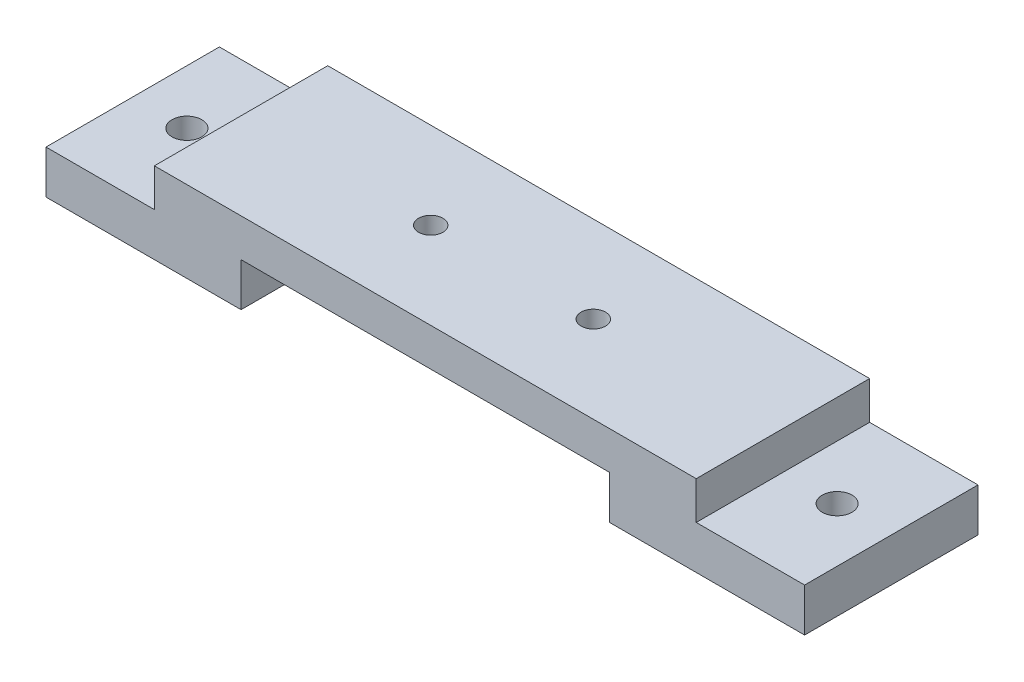
ISO-10303-21;
HEADER;
FILE_DESCRIPTION(('STEP AP214'),'2;1');
FILE_NAME('part.step','',(''),(''),'','','');
FILE_SCHEMA(('AUTOMOTIVE_DESIGN { 1 0 10303 214 1 1 1 1 }'));
ENDSEC;
DATA;
#1=APPLICATION_CONTEXT('core data for automotive mechanical design processes');
#2=APPLICATION_PROTOCOL_DEFINITION('international standard','automotive_design',2000,#1);
#3=PRODUCT_CONTEXT('',#1,'mechanical');
#4=PRODUCT('Part','Part','',(#3));
#5=PRODUCT_RELATED_PRODUCT_CATEGORY('part','',(#4));
#6=PRODUCT_DEFINITION_FORMATION('','',#4);
#7=PRODUCT_DEFINITION_CONTEXT('part definition',#1,'design');
#8=PRODUCT_DEFINITION('design','',#6,#7);
#9=PRODUCT_DEFINITION_SHAPE('','',#8);
#10=(LENGTH_UNIT() NAMED_UNIT(*) SI_UNIT(.MILLI.,.METRE.));
#11=(NAMED_UNIT(*) PLANE_ANGLE_UNIT() SI_UNIT($,.RADIAN.));
#12=(NAMED_UNIT(*) SI_UNIT($,.STERADIAN.) SOLID_ANGLE_UNIT());
#13=UNCERTAINTY_MEASURE_WITH_UNIT(LENGTH_MEASURE(1.E-05),#10,'distance_accuracy_value','');
#14=(GEOMETRIC_REPRESENTATION_CONTEXT(3) GLOBAL_UNCERTAINTY_ASSIGNED_CONTEXT((#13)) GLOBAL_UNIT_ASSIGNED_CONTEXT((#10,
#11,#12)) REPRESENTATION_CONTEXT('',''));
#15=CARTESIAN_POINT('',(0.,0.,0.));
#16=DIRECTION('',(0.,0.,1.));
#17=DIRECTION('',(1.,0.,0.));
#18=AXIS2_PLACEMENT_3D('',#15,#16,#17);
#19=CARTESIAN_POINT('',(50.,35.,-32.));
#20=DIRECTION('',(0.,1.,0.));
#21=DIRECTION('',(-1.,0.,0.));
#22=AXIS2_PLACEMENT_3D('',#19,#20,#21);
#23=PLANE('',#22);
#24=DIRECTION('',(-1.,0.,0.));
#25=VECTOR('',#24,1.);
#26=CARTESIAN_POINT('',(50.,35.,0.));
#27=LINE('',#26,#25);
#28=CARTESIAN_POINT('',(50.,35.,0.));
#29=VERTEX_POINT('',#28);
#30=CARTESIAN_POINT('',(-50.,35.,0.));
#31=VERTEX_POINT('',#30);
#32=EDGE_CURVE('E204',#29,#31,#27,.T.);
#33=ORIENTED_EDGE('',*,*,#32,.F.);
#34=DIRECTION('',(0.,0.,1.));
#35=VECTOR('',#34,1.);
#36=CARTESIAN_POINT('',(50.,35.,-32.));
#37=LINE('',#36,#35);
#38=CARTESIAN_POINT('',(50.,35.,-32.));
#39=VERTEX_POINT('',#38);
#40=EDGE_CURVE('E145',#39,#29,#37,.T.);
#41=ORIENTED_EDGE('',*,*,#40,.F.);
#42=DIRECTION('',(-1.,0.,0.));
#43=VECTOR('',#42,1.);
#44=CARTESIAN_POINT('',(50.,35.,-32.));
#45=LINE('',#44,#43);
#46=CARTESIAN_POINT('',(-50.,35.,-32.));
#47=VERTEX_POINT('',#46);
#48=EDGE_CURVE('E151',#39,#47,#45,.T.);
#49=ORIENTED_EDGE('',*,*,#48,.T.);
#50=DIRECTION('',(0.,0.,1.));
#51=VECTOR('',#50,1.);
#52=CARTESIAN_POINT('',(-50.,35.,-32.));
#53=LINE('',#52,#51);
#54=EDGE_CURVE('E134',#47,#31,#53,.T.);
#55=ORIENTED_EDGE('',*,*,#54,.T.);
#56=EDGE_LOOP('',(#33,#41,#49,#55));
#57=FACE_BOUND('',#56,.T.);
#58=CARTESIAN_POINT('',(15.,35.,-16.));
#59=DIRECTION('',(0.,-1.,0.));
#60=DIRECTION('',(0.,0.,-1.));
#61=AXIS2_PLACEMENT_3D('',#58,#59,#60);
#62=CIRCLE('',#61,2.25);
#63=CARTESIAN_POINT('',(15.,35.,-18.25));
#64=VERTEX_POINT('',#63);
#65=EDGE_CURVE('E172',#64,#64,#62,.T.);
#66=ORIENTED_EDGE('',*,*,#65,.T.);
#67=EDGE_LOOP('',(#66));
#68=FACE_BOUND('',#67,.T.);
#69=CARTESIAN_POINT('',(-15.,35.,-16.));
#70=DIRECTION('',(0.,-1.,0.));
#71=DIRECTION('',(0.,0.,-1.));
#72=AXIS2_PLACEMENT_3D('',#69,#70,#71);
#73=CIRCLE('',#72,2.25);
#74=CARTESIAN_POINT('',(-15.,35.,-18.25));
#75=VERTEX_POINT('',#74);
#76=EDGE_CURVE('E314',#75,#75,#73,.T.);
#77=ORIENTED_EDGE('',*,*,#76,.T.);
#78=EDGE_LOOP('',(#77));
#79=FACE_BOUND('',#78,.T.);
#80=ADVANCED_FACE('F39',(#57,#68,#79),#23,.T.);
#81=CARTESIAN_POINT('',(-70.,28.,-32.));
#82=DIRECTION('',(-1.,0.,0.));
#83=DIRECTION('',(0.,0.,1.));
#84=AXIS2_PLACEMENT_3D('',#81,#82,#83);
#85=PLANE('',#84);
#86=DIRECTION('',(0.,-1.,0.));
#87=VECTOR('',#86,1.);
#88=CARTESIAN_POINT('',(-70.,28.,0.));
#89=LINE('',#88,#87);
#90=CARTESIAN_POINT('',(-70.,28.,0.));
#91=VERTEX_POINT('',#90);
#92=CARTESIAN_POINT('',(-70.,20.,0.));
#93=VERTEX_POINT('',#92);
#94=EDGE_CURVE('E167',#91,#93,#89,.T.);
#95=ORIENTED_EDGE('',*,*,#94,.F.);
#96=DIRECTION('',(0.,0.,1.));
#97=VECTOR('',#96,1.);
#98=CARTESIAN_POINT('',(-70.,28.,-32.));
#99=LINE('',#98,#97);
#100=CARTESIAN_POINT('',(-70.,28.,-32.));
#101=VERTEX_POINT('',#100);
#102=EDGE_CURVE('E11',#101,#91,#99,.T.);
#103=ORIENTED_EDGE('',*,*,#102,.F.);
#104=DIRECTION('',(0.,-1.,0.));
#105=VECTOR('',#104,1.);
#106=CARTESIAN_POINT('',(-70.,28.,-32.));
#107=LINE('',#106,#105);
#108=CARTESIAN_POINT('',(-70.,20.,-32.));
#109=VERTEX_POINT('',#108);
#110=EDGE_CURVE('E212',#101,#109,#107,.T.);
#111=ORIENTED_EDGE('',*,*,#110,.T.);
#112=DIRECTION('',(0.,0.,1.));
#113=VECTOR('',#112,1.);
#114=CARTESIAN_POINT('',(-70.,20.,-32.));
#115=LINE('',#114,#113);
#116=EDGE_CURVE('E43',#109,#93,#115,.T.);
#117=ORIENTED_EDGE('',*,*,#116,.T.);
#118=EDGE_LOOP('',(#95,#103,#111,#117));
#119=FACE_BOUND('',#118,.T.);
#120=ADVANCED_FACE('F41',(#119),#85,.T.);
#121=CARTESIAN_POINT('',(-50.,28.,-32.));
#122=DIRECTION('',(0.,1.,0.));
#123=DIRECTION('',(-1.,0.,0.));
#124=AXIS2_PLACEMENT_3D('',#121,#122,#123);
#125=PLANE('',#124);
#126=CARTESIAN_POINT('',(-60.,28.,-16.));
#127=DIRECTION('',(0.,1.,0.));
#128=DIRECTION('',(0.,0.,1.));
#129=AXIS2_PLACEMENT_3D('',#126,#127,#128);
#130=CIRCLE('',#129,2.75);
#131=CARTESIAN_POINT('',(-60.,28.,-13.25));
#132=VERTEX_POINT('',#131);
#133=EDGE_CURVE('E297',#132,#132,#130,.T.);
#134=ORIENTED_EDGE('',*,*,#133,.F.);
#135=EDGE_LOOP('',(#134));
#136=FACE_BOUND('',#135,.T.);
#137=DIRECTION('',(-1.,0.,0.));
#138=VECTOR('',#137,1.);
#139=CARTESIAN_POINT('',(-50.,28.,0.));
#140=LINE('',#139,#138);
#141=CARTESIAN_POINT('',(-50.,28.,0.));
#142=VERTEX_POINT('',#141);
#143=EDGE_CURVE('E209',#142,#91,#140,.T.);
#144=ORIENTED_EDGE('',*,*,#143,.F.);
#145=DIRECTION('',(0.,0.,1.));
#146=VECTOR('',#145,1.);
#147=CARTESIAN_POINT('',(-50.,28.,-32.));
#148=LINE('',#147,#146);
#149=CARTESIAN_POINT('',(-50.,28.,-32.));
#150=VERTEX_POINT('',#149);
#151=EDGE_CURVE('E50',#150,#142,#148,.T.);
#152=ORIENTED_EDGE('',*,*,#151,.F.);
#153=DIRECTION('',(-1.,0.,0.));
#154=VECTOR('',#153,1.);
#155=CARTESIAN_POINT('',(-50.,28.,-32.));
#156=LINE('',#155,#154);
#157=EDGE_CURVE('E153',#150,#101,#156,.T.);
#158=ORIENTED_EDGE('',*,*,#157,.T.);
#159=ORIENTED_EDGE('',*,*,#102,.T.);
#160=EDGE_LOOP('',(#144,#152,#158,#159));
#161=FACE_BOUND('',#160,.T.);
#162=ADVANCED_FACE('F242',(#136,#161),#125,.T.);
#163=CARTESIAN_POINT('',(-50.,35.,-32.));
#164=DIRECTION('',(-1.,0.,0.));
#165=DIRECTION('',(0.,0.,1.));
#166=AXIS2_PLACEMENT_3D('',#163,#164,#165);
#167=PLANE('',#166);
#168=DIRECTION('',(0.,-1.,0.));
#169=VECTOR('',#168,1.);
#170=CARTESIAN_POINT('',(-50.,35.,0.));
#171=LINE('',#170,#169);
#172=EDGE_CURVE('E139',#31,#142,#171,.T.);
#173=ORIENTED_EDGE('',*,*,#172,.F.);
#174=ORIENTED_EDGE('',*,*,#54,.F.);
#175=DIRECTION('',(0.,-1.,0.));
#176=VECTOR('',#175,1.);
#177=CARTESIAN_POINT('',(-50.,35.,-32.));
#178=LINE('',#177,#176);
#179=EDGE_CURVE('E137',#47,#150,#178,.T.);
#180=ORIENTED_EDGE('',*,*,#179,.T.);
#181=ORIENTED_EDGE('',*,*,#151,.T.);
#182=EDGE_LOOP('',(#173,#174,#180,#181));
#183=FACE_BOUND('',#182,.T.);
#184=ADVANCED_FACE('F136',(#183),#167,.T.);
#185=CARTESIAN_POINT('',(50.,28.,-32.));
#186=DIRECTION('',(1.,0.,0.));
#187=DIRECTION('',(0.,0.,-1.));
#188=AXIS2_PLACEMENT_3D('',#185,#186,#187);
#189=PLANE('',#188);
#190=DIRECTION('',(0.,1.,0.));
#191=VECTOR('',#190,1.);
#192=CARTESIAN_POINT('',(50.,28.,0.));
#193=LINE('',#192,#191);
#194=CARTESIAN_POINT('',(50.,28.,0.));
#195=VERTEX_POINT('',#194);
#196=EDGE_CURVE('E200',#195,#29,#193,.T.);
#197=ORIENTED_EDGE('',*,*,#196,.F.);
#198=DIRECTION('',(0.,0.,1.));
#199=VECTOR('',#198,1.);
#200=CARTESIAN_POINT('',(50.,28.,-32.));
#201=LINE('',#200,#199);
#202=CARTESIAN_POINT('',(50.,28.,-32.));
#203=VERTEX_POINT('',#202);
#204=EDGE_CURVE('E218',#203,#195,#201,.T.);
#205=ORIENTED_EDGE('',*,*,#204,.F.);
#206=DIRECTION('',(0.,1.,0.));
#207=VECTOR('',#206,1.);
#208=CARTESIAN_POINT('',(50.,28.,-32.));
#209=LINE('',#208,#207);
#210=EDGE_CURVE('E158',#203,#39,#209,.T.);
#211=ORIENTED_EDGE('',*,*,#210,.T.);
#212=ORIENTED_EDGE('',*,*,#40,.T.);
#213=EDGE_LOOP('',(#197,#205,#211,#212));
#214=FACE_BOUND('',#213,.T.);
#215=ADVANCED_FACE('F250',(#214),#189,.T.);
#216=CARTESIAN_POINT('',(70.,28.,-32.));
#217=DIRECTION('',(0.,1.,0.));
#218=DIRECTION('',(-1.,0.,0.));
#219=AXIS2_PLACEMENT_3D('',#216,#217,#218);
#220=PLANE('',#219);
#221=CARTESIAN_POINT('',(60.,28.,-16.));
#222=DIRECTION('',(0.,1.,0.));
#223=DIRECTION('',(0.,0.,1.));
#224=AXIS2_PLACEMENT_3D('',#221,#222,#223);
#225=CIRCLE('',#224,2.75);
#226=CARTESIAN_POINT('',(60.,28.,-13.25));
#227=VERTEX_POINT('',#226);
#228=EDGE_CURVE('E296',#227,#227,#225,.T.);
#229=ORIENTED_EDGE('',*,*,#228,.F.);
#230=EDGE_LOOP('',(#229));
#231=FACE_BOUND('',#230,.T.);
#232=DIRECTION('',(-1.,0.,0.));
#233=VECTOR('',#232,1.);
#234=CARTESIAN_POINT('',(70.,28.,0.));
#235=LINE('',#234,#233);
#236=CARTESIAN_POINT('',(70.,28.,0.));
#237=VERTEX_POINT('',#236);
#238=EDGE_CURVE('E196',#237,#195,#235,.T.);
#239=ORIENTED_EDGE('',*,*,#238,.F.);
#240=DIRECTION('',(0.,0.,1.));
#241=VECTOR('',#240,1.);
#242=CARTESIAN_POINT('',(70.,28.,-32.));
#243=LINE('',#242,#241);
#244=CARTESIAN_POINT('',(70.,28.,-32.));
#245=VERTEX_POINT('',#244);
#246=EDGE_CURVE('E221',#245,#237,#243,.T.);
#247=ORIENTED_EDGE('',*,*,#246,.F.);
#248=DIRECTION('',(-1.,0.,0.));
#249=VECTOR('',#248,1.);
#250=CARTESIAN_POINT('',(70.,28.,-32.));
#251=LINE('',#250,#249);
#252=EDGE_CURVE('E161',#245,#203,#251,.T.);
#253=ORIENTED_EDGE('',*,*,#252,.T.);
#254=ORIENTED_EDGE('',*,*,#204,.T.);
#255=EDGE_LOOP('',(#239,#247,#253,#254));
#256=FACE_BOUND('',#255,.T.);
#257=ADVANCED_FACE('F261',(#231,#256),#220,.T.);
#258=CARTESIAN_POINT('',(70.,20.,-32.));
#259=DIRECTION('',(1.,0.,0.));
#260=DIRECTION('',(0.,0.,-1.));
#261=AXIS2_PLACEMENT_3D('',#258,#259,#260);
#262=PLANE('',#261);
#263=DIRECTION('',(0.,1.,0.));
#264=VECTOR('',#263,1.);
#265=CARTESIAN_POINT('',(70.,20.,0.));
#266=LINE('',#265,#264);
#267=CARTESIAN_POINT('',(70.,20.,0.));
#268=VERTEX_POINT('',#267);
#269=EDGE_CURVE('E192',#268,#237,#266,.T.);
#270=ORIENTED_EDGE('',*,*,#269,.F.);
#271=DIRECTION('',(0.,0.,1.));
#272=VECTOR('',#271,1.);
#273=CARTESIAN_POINT('',(70.,20.,-32.));
#274=LINE('',#273,#272);
#275=CARTESIAN_POINT('',(70.,20.,-32.));
#276=VERTEX_POINT('',#275);
#277=EDGE_CURVE('E224',#276,#268,#274,.T.);
#278=ORIENTED_EDGE('',*,*,#277,.F.);
#279=DIRECTION('',(0.,1.,0.));
#280=VECTOR('',#279,1.);
#281=CARTESIAN_POINT('',(70.,20.,-32.));
#282=LINE('',#281,#280);
#283=EDGE_CURVE('E346',#276,#245,#282,.T.);
#284=ORIENTED_EDGE('',*,*,#283,.T.);
#285=ORIENTED_EDGE('',*,*,#246,.T.);
#286=EDGE_LOOP('',(#270,#278,#284,#285));
#287=FACE_BOUND('',#286,.T.);
#288=ADVANCED_FACE('F265',(#287),#262,.T.);
#289=CARTESIAN_POINT('',(34.,20.,-32.));
#290=DIRECTION('',(0.,-1.,0.));
#291=DIRECTION('',(0.,0.,-1.));
#292=AXIS2_PLACEMENT_3D('',#289,#290,#291);
#293=PLANE('',#292);
#294=CARTESIAN_POINT('',(60.,20.,-16.));
#295=DIRECTION('',(0.,1.,0.));
#296=DIRECTION('',(0.,0.,1.));
#297=AXIS2_PLACEMENT_3D('',#294,#295,#296);
#298=CIRCLE('',#297,2.75);
#299=CARTESIAN_POINT('',(60.,20.,-13.25));
#300=VERTEX_POINT('',#299);
#301=EDGE_CURVE('E302',#300,#300,#298,.T.);
#302=ORIENTED_EDGE('',*,*,#301,.T.);
#303=EDGE_LOOP('',(#302));
#304=FACE_BOUND('',#303,.T.);
#305=DIRECTION('',(1.,0.,0.));
#306=VECTOR('',#305,1.);
#307=CARTESIAN_POINT('',(34.,20.,0.));
#308=LINE('',#307,#306);
#309=CARTESIAN_POINT('',(34.,20.,0.));
#310=VERTEX_POINT('',#309);
#311=EDGE_CURVE('E188',#310,#268,#308,.T.);
#312=ORIENTED_EDGE('',*,*,#311,.F.);
#313=DIRECTION('',(0.,0.,1.));
#314=VECTOR('',#313,1.);
#315=CARTESIAN_POINT('',(34.,20.,-32.));
#316=LINE('',#315,#314);
#317=CARTESIAN_POINT('',(34.,20.,-32.));
#318=VERTEX_POINT('',#317);
#319=EDGE_CURVE('E227',#318,#310,#316,.T.);
#320=ORIENTED_EDGE('',*,*,#319,.F.);
#321=DIRECTION('',(1.,0.,0.));
#322=VECTOR('',#321,1.);
#323=CARTESIAN_POINT('',(34.,20.,-32.));
#324=LINE('',#323,#322);
#325=EDGE_CURVE('E342',#318,#276,#324,.T.);
#326=ORIENTED_EDGE('',*,*,#325,.T.);
#327=ORIENTED_EDGE('',*,*,#277,.T.);
#328=EDGE_LOOP('',(#312,#320,#326,#327));
#329=FACE_BOUND('',#328,.T.);
#330=ADVANCED_FACE('F269',(#304,#329),#293,.T.);
#331=CARTESIAN_POINT('',(34.,28.,-32.));
#332=DIRECTION('',(-1.,0.,0.));
#333=DIRECTION('',(0.,0.,1.));
#334=AXIS2_PLACEMENT_3D('',#331,#332,#333);
#335=PLANE('',#334);
#336=DIRECTION('',(0.,-1.,0.));
#337=VECTOR('',#336,1.);
#338=CARTESIAN_POINT('',(34.,28.,0.));
#339=LINE('',#338,#337);
#340=CARTESIAN_POINT('',(34.,28.,0.));
#341=VERTEX_POINT('',#340);
#342=EDGE_CURVE('E184',#341,#310,#339,.T.);
#343=ORIENTED_EDGE('',*,*,#342,.F.);
#344=DIRECTION('',(0.,0.,1.));
#345=VECTOR('',#344,1.);
#346=CARTESIAN_POINT('',(34.,28.,-32.));
#347=LINE('',#346,#345);
#348=CARTESIAN_POINT('',(34.,28.,-32.));
#349=VERTEX_POINT('',#348);
#350=EDGE_CURVE('E230',#349,#341,#347,.T.);
#351=ORIENTED_EDGE('',*,*,#350,.F.);
#352=DIRECTION('',(0.,-1.,0.));
#353=VECTOR('',#352,1.);
#354=CARTESIAN_POINT('',(34.,28.,-32.));
#355=LINE('',#354,#353);
#356=EDGE_CURVE('E338',#349,#318,#355,.T.);
#357=ORIENTED_EDGE('',*,*,#356,.T.);
#358=ORIENTED_EDGE('',*,*,#319,.T.);
#359=EDGE_LOOP('',(#343,#351,#357,#358));
#360=FACE_BOUND('',#359,.T.);
#361=ADVANCED_FACE('F273',(#360),#335,.T.);
#362=CARTESIAN_POINT('',(-34.,28.,-32.));
#363=DIRECTION('',(0.,-1.,0.));
#364=DIRECTION('',(0.,0.,-1.));
#365=AXIS2_PLACEMENT_3D('',#362,#363,#364);
#366=PLANE('',#365);
#367=CARTESIAN_POINT('',(-15.,28.,-16.));
#368=DIRECTION('',(0.,-1.,0.));
#369=DIRECTION('',(0.,0.,-1.));
#370=AXIS2_PLACEMENT_3D('',#367,#368,#369);
#371=CIRCLE('',#370,2.25);
#372=CARTESIAN_POINT('',(-15.,28.,-18.25));
#373=VERTEX_POINT('',#372);
#374=EDGE_CURVE('E310',#373,#373,#371,.T.);
#375=ORIENTED_EDGE('',*,*,#374,.F.);
#376=EDGE_LOOP('',(#375));
#377=FACE_BOUND('',#376,.T.);
#378=CARTESIAN_POINT('',(15.,28.,-16.));
#379=DIRECTION('',(0.,-1.,0.));
#380=DIRECTION('',(0.,0.,-1.));
#381=AXIS2_PLACEMENT_3D('',#378,#379,#380);
#382=CIRCLE('',#381,2.25);
#383=CARTESIAN_POINT('',(15.,28.,-18.25));
#384=VERTEX_POINT('',#383);
#385=EDGE_CURVE('E318',#384,#384,#382,.T.);
#386=ORIENTED_EDGE('',*,*,#385,.F.);
#387=EDGE_LOOP('',(#386));
#388=FACE_BOUND('',#387,.T.);
#389=DIRECTION('',(1.,0.,0.));
#390=VECTOR('',#389,1.);
#391=CARTESIAN_POINT('',(-34.,28.,0.));
#392=LINE('',#391,#390);
#393=CARTESIAN_POINT('',(-34.,28.,0.));
#394=VERTEX_POINT('',#393);
#395=EDGE_CURVE('E180',#394,#341,#392,.T.);
#396=ORIENTED_EDGE('',*,*,#395,.F.);
#397=DIRECTION('',(0.,0.,1.));
#398=VECTOR('',#397,1.);
#399=CARTESIAN_POINT('',(-34.,28.,-32.));
#400=LINE('',#399,#398);
#401=CARTESIAN_POINT('',(-34.,28.,-32.));
#402=VERTEX_POINT('',#401);
#403=EDGE_CURVE('E233',#402,#394,#400,.T.);
#404=ORIENTED_EDGE('',*,*,#403,.F.);
#405=DIRECTION('',(1.,0.,0.));
#406=VECTOR('',#405,1.);
#407=CARTESIAN_POINT('',(-34.,28.,-32.));
#408=LINE('',#407,#406);
#409=EDGE_CURVE('E334',#402,#349,#408,.T.);
#410=ORIENTED_EDGE('',*,*,#409,.T.);
#411=ORIENTED_EDGE('',*,*,#350,.T.);
#412=EDGE_LOOP('',(#396,#404,#410,#411));
#413=FACE_BOUND('',#412,.T.);
#414=ADVANCED_FACE('F277',(#377,#388,#413),#366,.T.);
#415=CARTESIAN_POINT('',(-34.,20.,-32.));
#416=DIRECTION('',(1.,0.,0.));
#417=DIRECTION('',(0.,0.,-1.));
#418=AXIS2_PLACEMENT_3D('',#415,#416,#417);
#419=PLANE('',#418);
#420=DIRECTION('',(0.,1.,0.));
#421=VECTOR('',#420,1.);
#422=CARTESIAN_POINT('',(-34.,20.,0.));
#423=LINE('',#422,#421);
#424=CARTESIAN_POINT('',(-34.,20.,0.));
#425=VERTEX_POINT('',#424);
#426=EDGE_CURVE('E176',#425,#394,#423,.T.);
#427=ORIENTED_EDGE('',*,*,#426,.F.);
#428=DIRECTION('',(0.,0.,1.));
#429=VECTOR('',#428,1.);
#430=CARTESIAN_POINT('',(-34.,20.,-32.));
#431=LINE('',#430,#429);
#432=CARTESIAN_POINT('',(-34.,20.,-32.));
#433=VERTEX_POINT('',#432);
#434=EDGE_CURVE('E235',#433,#425,#431,.T.);
#435=ORIENTED_EDGE('',*,*,#434,.F.);
#436=DIRECTION('',(0.,1.,0.));
#437=VECTOR('',#436,1.);
#438=CARTESIAN_POINT('',(-34.,20.,-32.));
#439=LINE('',#438,#437);
#440=EDGE_CURVE('E330',#433,#402,#439,.T.);
#441=ORIENTED_EDGE('',*,*,#440,.T.);
#442=ORIENTED_EDGE('',*,*,#403,.T.);
#443=EDGE_LOOP('',(#427,#435,#441,#442));
#444=FACE_BOUND('',#443,.T.);
#445=ADVANCED_FACE('F281',(#444),#419,.T.);
#446=CARTESIAN_POINT('',(-70.,20.,-32.));
#447=DIRECTION('',(0.,-1.,0.));
#448=DIRECTION('',(0.,0.,-1.));
#449=AXIS2_PLACEMENT_3D('',#446,#447,#448);
#450=PLANE('',#449);
#451=CARTESIAN_POINT('',(-60.,20.,-16.));
#452=DIRECTION('',(0.,1.,0.));
#453=DIRECTION('',(0.,0.,1.));
#454=AXIS2_PLACEMENT_3D('',#451,#452,#453);
#455=CIRCLE('',#454,2.75);
#456=CARTESIAN_POINT('',(-60.,20.,-13.25));
#457=VERTEX_POINT('',#456);
#458=EDGE_CURVE('E293',#457,#457,#455,.T.);
#459=ORIENTED_EDGE('',*,*,#458,.T.);
#460=EDGE_LOOP('',(#459));
#461=FACE_BOUND('',#460,.T.);
#462=DIRECTION('',(1.,0.,0.));
#463=VECTOR('',#462,1.);
#464=CARTESIAN_POINT('',(-70.,20.,0.));
#465=LINE('',#464,#463);
#466=EDGE_CURVE('E171',#93,#425,#465,.T.);
#467=ORIENTED_EDGE('',*,*,#466,.F.);
#468=ORIENTED_EDGE('',*,*,#116,.F.);
#469=DIRECTION('',(1.,0.,0.));
#470=VECTOR('',#469,1.);
#471=CARTESIAN_POINT('',(-70.,20.,-32.));
#472=LINE('',#471,#470);
#473=EDGE_CURVE('E327',#109,#433,#472,.T.);
#474=ORIENTED_EDGE('',*,*,#473,.T.);
#475=ORIENTED_EDGE('',*,*,#434,.T.);
#476=EDGE_LOOP('',(#467,#468,#474,#475));
#477=FACE_BOUND('',#476,.T.);
#478=ADVANCED_FACE('F239',(#461,#477),#450,.T.);
#479=CARTESIAN_POINT('',(0.,0.,-32.));
#480=DIRECTION('',(0.,0.,1.));
#481=DIRECTION('',(1.,0.,0.));
#482=AXIS2_PLACEMENT_3D('',#479,#480,#481);
#483=PLANE('',#482);
#484=ORIENTED_EDGE('',*,*,#110,.F.);
#485=ORIENTED_EDGE('',*,*,#157,.F.);
#486=ORIENTED_EDGE('',*,*,#179,.F.);
#487=ORIENTED_EDGE('',*,*,#48,.F.);
#488=ORIENTED_EDGE('',*,*,#210,.F.);
#489=ORIENTED_EDGE('',*,*,#252,.F.);
#490=ORIENTED_EDGE('',*,*,#283,.F.);
#491=ORIENTED_EDGE('',*,*,#325,.F.);
#492=ORIENTED_EDGE('',*,*,#356,.F.);
#493=ORIENTED_EDGE('',*,*,#409,.F.);
#494=ORIENTED_EDGE('',*,*,#440,.F.);
#495=ORIENTED_EDGE('',*,*,#473,.F.);
#496=EDGE_LOOP('',(#484,#485,#486,#487,#488,#489,#490,#491,#492,#493,#494,#495));
#497=FACE_BOUND('',#496,.T.);
#498=ADVANCED_FACE('F149',(#497),#483,.F.);
#499=CARTESIAN_POINT('',(0.,0.,0.));
#500=DIRECTION('',(0.,0.,1.));
#501=DIRECTION('',(1.,0.,0.));
#502=AXIS2_PLACEMENT_3D('',#499,#500,#501);
#503=PLANE('',#502);
#504=ORIENTED_EDGE('',*,*,#94,.T.);
#505=ORIENTED_EDGE('',*,*,#466,.T.);
#506=ORIENTED_EDGE('',*,*,#426,.T.);
#507=ORIENTED_EDGE('',*,*,#395,.T.);
#508=ORIENTED_EDGE('',*,*,#342,.T.);
#509=ORIENTED_EDGE('',*,*,#311,.T.);
#510=ORIENTED_EDGE('',*,*,#269,.T.);
#511=ORIENTED_EDGE('',*,*,#238,.T.);
#512=ORIENTED_EDGE('',*,*,#196,.T.);
#513=ORIENTED_EDGE('',*,*,#32,.T.);
#514=ORIENTED_EDGE('',*,*,#172,.T.);
#515=ORIENTED_EDGE('',*,*,#143,.T.);
#516=EDGE_LOOP('',(#504,#505,#506,#507,#508,#509,#510,#511,#512,#513,#514,#515));
#517=FACE_BOUND('',#516,.T.);
#518=ADVANCED_FACE('F241',(#517),#503,.T.);
#519=CARTESIAN_POINT('',(15.,28.,-16.));
#520=DIRECTION('',(0.,-1.,0.));
#521=DIRECTION('',(0.,0.,-1.));
#522=AXIS2_PLACEMENT_3D('',#519,#520,#521);
#523=CYLINDRICAL_SURFACE('',#522,2.25);
#524=ORIENTED_EDGE('',*,*,#65,.F.);
#525=EDGE_LOOP('',(#524));
#526=FACE_BOUND('',#525,.T.);
#527=ORIENTED_EDGE('',*,*,#385,.T.);
#528=EDGE_LOOP('',(#527));
#529=FACE_BOUND('',#528,.T.);
#530=ADVANCED_FACE('F369',(#526,#529),#523,.F.);
#531=CARTESIAN_POINT('',(-15.,28.,-16.));
#532=DIRECTION('',(0.,-1.,0.));
#533=DIRECTION('',(0.,0.,-1.));
#534=AXIS2_PLACEMENT_3D('',#531,#532,#533);
#535=CYLINDRICAL_SURFACE('',#534,2.25);
#536=ORIENTED_EDGE('',*,*,#76,.F.);
#537=EDGE_LOOP('',(#536));
#538=FACE_BOUND('',#537,.T.);
#539=ORIENTED_EDGE('',*,*,#374,.T.);
#540=EDGE_LOOP('',(#539));
#541=FACE_BOUND('',#540,.T.);
#542=ADVANCED_FACE('F372',(#538,#541),#535,.F.);
#543=CARTESIAN_POINT('',(60.,28.,-16.));
#544=DIRECTION('',(0.,1.,0.));
#545=DIRECTION('',(0.,0.,1.));
#546=AXIS2_PLACEMENT_3D('',#543,#544,#545);
#547=CYLINDRICAL_SURFACE('',#546,2.75);
#548=ORIENTED_EDGE('',*,*,#301,.F.);
#549=EDGE_LOOP('',(#548));
#550=FACE_BOUND('',#549,.T.);
#551=ORIENTED_EDGE('',*,*,#228,.T.);
#552=EDGE_LOOP('',(#551));
#553=FACE_BOUND('',#552,.T.);
#554=ADVANCED_FACE('F380',(#550,#553),#547,.F.);
#555=CARTESIAN_POINT('',(-60.,28.,-16.));
#556=DIRECTION('',(0.,1.,0.));
#557=DIRECTION('',(0.,0.,1.));
#558=AXIS2_PLACEMENT_3D('',#555,#556,#557);
#559=CYLINDRICAL_SURFACE('',#558,2.75);
#560=ORIENTED_EDGE('',*,*,#458,.F.);
#561=EDGE_LOOP('',(#560));
#562=FACE_BOUND('',#561,.T.);
#563=ORIENTED_EDGE('',*,*,#133,.T.);
#564=EDGE_LOOP('',(#563));
#565=FACE_BOUND('',#564,.T.);
#566=ADVANCED_FACE('F386',(#562,#565),#559,.F.);
#567=CLOSED_SHELL('',(#80,#120,#162,#184,#215,#257,#288,#330,#361,#414,#445,#478,#498,#518,#530,
#542,#554,#566));
#568=MANIFOLD_SOLID_BREP('B2',#567);
#569=ADVANCED_BREP_SHAPE_REPRESENTATION('',(#18,#568),#14);
#570=SHAPE_DEFINITION_REPRESENTATION(#9,#569);
ENDSEC;
END-ISO-10303-21;
